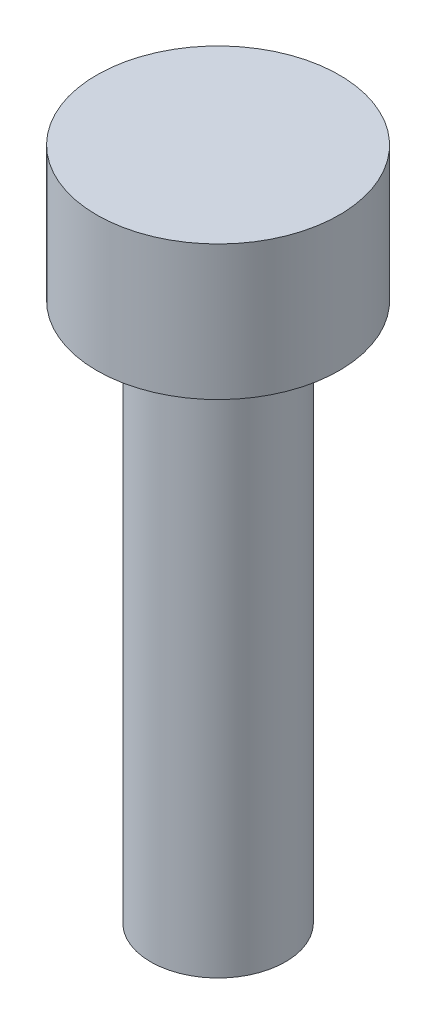
ISO-10303-21;
HEADER;
FILE_DESCRIPTION(('STEP AP214'),'2;1');
FILE_NAME('part.step','',(''),(''),'','','');
FILE_SCHEMA(('AUTOMOTIVE_DESIGN { 1 0 10303 214 1 1 1 1 }'));
ENDSEC;
DATA;
#1=APPLICATION_CONTEXT('core data for automotive mechanical design processes');
#2=APPLICATION_PROTOCOL_DEFINITION('international standard','automotive_design',2000,#1);
#3=PRODUCT_CONTEXT('',#1,'mechanical');
#4=PRODUCT('Part','Part','',(#3));
#5=PRODUCT_RELATED_PRODUCT_CATEGORY('part','',(#4));
#6=PRODUCT_DEFINITION_FORMATION('','',#4);
#7=PRODUCT_DEFINITION_CONTEXT('part definition',#1,'design');
#8=PRODUCT_DEFINITION('design','',#6,#7);
#9=PRODUCT_DEFINITION_SHAPE('','',#8);
#10=(LENGTH_UNIT() NAMED_UNIT(*) SI_UNIT(.MILLI.,.METRE.));
#11=(NAMED_UNIT(*) PLANE_ANGLE_UNIT() SI_UNIT($,.RADIAN.));
#12=(NAMED_UNIT(*) SI_UNIT($,.STERADIAN.) SOLID_ANGLE_UNIT());
#13=UNCERTAINTY_MEASURE_WITH_UNIT(LENGTH_MEASURE(1.E-05),#10,'distance_accuracy_value','');
#14=(GEOMETRIC_REPRESENTATION_CONTEXT(3) GLOBAL_UNCERTAINTY_ASSIGNED_CONTEXT((#13)) GLOBAL_UNIT_ASSIGNED_CONTEXT((#10,
#11,#12)) REPRESENTATION_CONTEXT('',''));
#15=CARTESIAN_POINT('',(0.,0.,0.));
#16=DIRECTION('',(0.,0.,1.));
#17=DIRECTION('',(1.,0.,0.));
#18=AXIS2_PLACEMENT_3D('',#15,#16,#17);
#19=CARTESIAN_POINT('',(0.,12.,0.));
#20=DIRECTION('',(0.,-1.,0.));
#21=DIRECTION('',(0.,0.,-1.));
#22=AXIS2_PLACEMENT_3D('',#19,#20,#21);
#23=CYLINDRICAL_SURFACE('',#22,1.5);
#24=CARTESIAN_POINT('',(0.,12.,0.));
#25=DIRECTION('',(0.,1.,0.));
#26=DIRECTION('',(0.,0.,1.));
#27=AXIS2_PLACEMENT_3D('',#24,#25,#26);
#28=CIRCLE('',#27,1.5);
#29=CARTESIAN_POINT('',(0.,12.,1.5));
#30=VERTEX_POINT('',#29);
#31=EDGE_CURVE('E10',#30,#30,#28,.T.);
#32=ORIENTED_EDGE('',*,*,#31,.F.);
#33=EDGE_LOOP('',(#32));
#34=FACE_BOUND('',#33,.T.);
#35=CARTESIAN_POINT('',(0.,0.,0.));
#36=DIRECTION('',(0.,1.,0.));
#37=DIRECTION('',(0.,0.,1.));
#38=AXIS2_PLACEMENT_3D('',#35,#36,#37);
#39=CIRCLE('',#38,1.5);
#40=CARTESIAN_POINT('',(0.,0.,1.5));
#41=VERTEX_POINT('',#40);
#42=EDGE_CURVE('E34',#41,#41,#39,.T.);
#43=ORIENTED_EDGE('',*,*,#42,.T.);
#44=EDGE_LOOP('',(#43));
#45=FACE_BOUND('',#44,.T.);
#46=ADVANCED_FACE('F31',(#34,#45),#23,.T.);
#47=CARTESIAN_POINT('',(0.,0.,0.));
#48=DIRECTION('',(0.,1.,0.));
#49=DIRECTION('',(0.,0.,1.));
#50=AXIS2_PLACEMENT_3D('',#47,#48,#49);
#51=PLANE('',#50);
#52=ORIENTED_EDGE('',*,*,#42,.F.);
#53=EDGE_LOOP('',(#52));
#54=FACE_BOUND('',#53,.T.);
#55=ADVANCED_FACE('F54',(#54),#51,.F.);
#56=CARTESIAN_POINT('',(0.,15.,0.));
#57=DIRECTION('',(0.,-1.,0.));
#58=DIRECTION('',(0.,0.,-1.));
#59=AXIS2_PLACEMENT_3D('',#56,#57,#58);
#60=CYLINDRICAL_SURFACE('',#59,2.7);
#61=CARTESIAN_POINT('',(0.,15.,0.));
#62=DIRECTION('',(0.,1.,0.));
#63=DIRECTION('',(0.,0.,1.));
#64=AXIS2_PLACEMENT_3D('',#61,#62,#63);
#65=CIRCLE('',#64,2.7);
#66=CARTESIAN_POINT('',(0.,15.,2.7));
#67=VERTEX_POINT('',#66);
#68=EDGE_CURVE('E41',#67,#67,#65,.T.);
#69=ORIENTED_EDGE('',*,*,#68,.F.);
#70=EDGE_LOOP('',(#69));
#71=FACE_BOUND('',#70,.T.);
#72=CARTESIAN_POINT('',(0.,12.,0.));
#73=DIRECTION('',(0.,1.,0.));
#74=DIRECTION('',(0.,0.,1.));
#75=AXIS2_PLACEMENT_3D('',#72,#73,#74);
#76=CIRCLE('',#75,2.7);
#77=CARTESIAN_POINT('',(0.,12.,2.7));
#78=VERTEX_POINT('',#77);
#79=EDGE_CURVE('E43',#78,#78,#76,.T.);
#80=ORIENTED_EDGE('',*,*,#79,.T.);
#81=EDGE_LOOP('',(#80));
#82=FACE_BOUND('',#81,.T.);
#83=ADVANCED_FACE('F51',(#71,#82),#60,.T.);
#84=CARTESIAN_POINT('',(0.,15.,0.));
#85=DIRECTION('',(0.,1.,0.));
#86=DIRECTION('',(0.,0.,1.));
#87=AXIS2_PLACEMENT_3D('',#84,#85,#86);
#88=PLANE('',#87);
#89=ORIENTED_EDGE('',*,*,#68,.T.);
#90=EDGE_LOOP('',(#89));
#91=FACE_BOUND('',#90,.T.);
#92=ADVANCED_FACE('F49',(#91),#88,.T.);
#93=CARTESIAN_POINT('',(0.,12.,0.));
#94=DIRECTION('',(0.,1.,0.));
#95=DIRECTION('',(0.,0.,1.));
#96=AXIS2_PLACEMENT_3D('',#93,#94,#95);
#97=PLANE('',#96);
#98=ORIENTED_EDGE('',*,*,#31,.T.);
#99=EDGE_LOOP('',(#98));
#100=FACE_BOUND('',#99,.T.);
#101=ORIENTED_EDGE('',*,*,#79,.F.);
#102=EDGE_LOOP('',(#101));
#103=FACE_BOUND('',#102,.T.);
#104=ADVANCED_FACE('F58',(#100,#103),#97,.F.);
#105=CLOSED_SHELL('',(#46,#55,#83,#92,#104));
#106=MANIFOLD_SOLID_BREP('B2',#105);
#107=ADVANCED_BREP_SHAPE_REPRESENTATION('',(#18,#106),#14);
#108=SHAPE_DEFINITION_REPRESENTATION(#9,#107);
ENDSEC;
END-ISO-10303-21;
